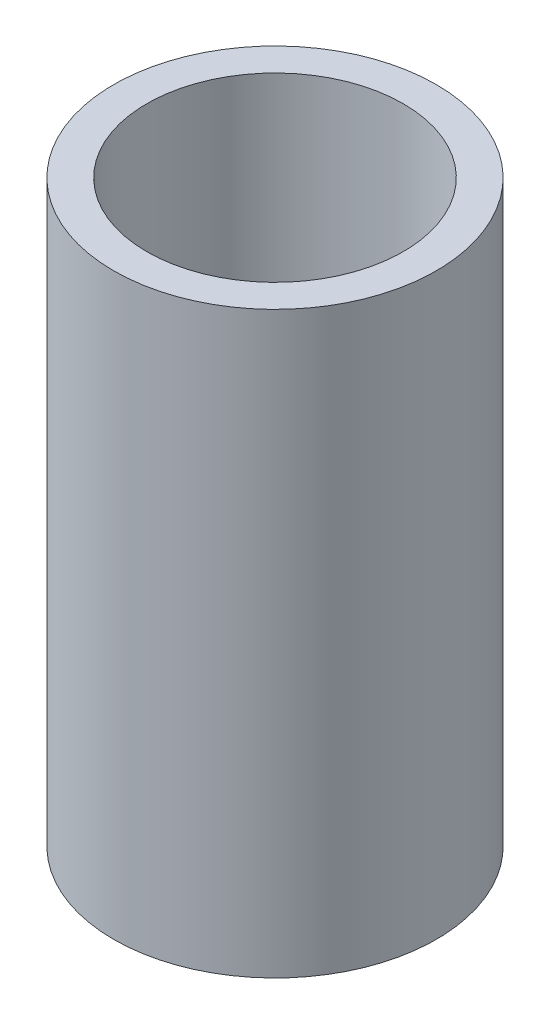
ISO-10303-21;
HEADER;
FILE_DESCRIPTION(('STEP AP214'),'2;1');
FILE_NAME('part.step','',(''),(''),'','','');
FILE_SCHEMA(('AUTOMOTIVE_DESIGN { 1 0 10303 214 1 1 1 1 }'));
ENDSEC;
DATA;
#1=APPLICATION_CONTEXT('core data for automotive mechanical design processes');
#2=APPLICATION_PROTOCOL_DEFINITION('international standard','automotive_design',2000,#1);
#3=PRODUCT_CONTEXT('',#1,'mechanical');
#4=PRODUCT('Part','Part','',(#3));
#5=PRODUCT_RELATED_PRODUCT_CATEGORY('part','',(#4));
#6=PRODUCT_DEFINITION_FORMATION('','',#4);
#7=PRODUCT_DEFINITION_CONTEXT('part definition',#1,'design');
#8=PRODUCT_DEFINITION('design','',#6,#7);
#9=PRODUCT_DEFINITION_SHAPE('','',#8);
#10=(LENGTH_UNIT() NAMED_UNIT(*) SI_UNIT(.MILLI.,.METRE.));
#11=(NAMED_UNIT(*) PLANE_ANGLE_UNIT() SI_UNIT($,.RADIAN.));
#12=(NAMED_UNIT(*) SI_UNIT($,.STERADIAN.) SOLID_ANGLE_UNIT());
#13=UNCERTAINTY_MEASURE_WITH_UNIT(LENGTH_MEASURE(1.E-05),#10,'distance_accuracy_value','');
#14=(GEOMETRIC_REPRESENTATION_CONTEXT(3) GLOBAL_UNCERTAINTY_ASSIGNED_CONTEXT((#13)) GLOBAL_UNIT_ASSIGNED_CONTEXT((#10,
#11,#12)) REPRESENTATION_CONTEXT('',''));
#15=CARTESIAN_POINT('',(0.,0.,0.));
#16=DIRECTION('',(0.,0.,1.));
#17=DIRECTION('',(1.,0.,0.));
#18=AXIS2_PLACEMENT_3D('',#15,#16,#17);
#19=CARTESIAN_POINT('',(0.,35.,0.));
#20=DIRECTION('',(0.,1.,0.));
#21=DIRECTION('',(0.,0.,1.));
#22=AXIS2_PLACEMENT_3D('',#19,#20,#21);
#23=PLANE('',#22);
#24=CARTESIAN_POINT('',(0.,35.,0.));
#25=DIRECTION('',(0.,1.,0.));
#26=DIRECTION('',(0.,0.,1.));
#27=AXIS2_PLACEMENT_3D('',#24,#25,#26);
#28=CIRCLE('',#27,9.75);
#29=CARTESIAN_POINT('',(0.,35.,9.75));
#30=VERTEX_POINT('',#29);
#31=EDGE_CURVE('E10',#30,#30,#28,.T.);
#32=ORIENTED_EDGE('',*,*,#31,.T.);
#33=EDGE_LOOP('',(#32));
#34=FACE_BOUND('',#33,.T.);
#35=CARTESIAN_POINT('',(0.,35.,0.));
#36=DIRECTION('',(0.,1.,0.));
#37=DIRECTION('',(0.,0.,1.));
#38=AXIS2_PLACEMENT_3D('',#35,#36,#37);
#39=CIRCLE('',#38,7.75);
#40=CARTESIAN_POINT('',(0.,35.,7.75));
#41=VERTEX_POINT('',#40);
#42=EDGE_CURVE('E43',#41,#41,#39,.T.);
#43=ORIENTED_EDGE('',*,*,#42,.F.);
#44=EDGE_LOOP('',(#43));
#45=FACE_BOUND('',#44,.T.);
#46=ADVANCED_FACE('F32',(#34,#45),#23,.T.);
#47=CARTESIAN_POINT('',(0.,0.,0.));
#48=DIRECTION('',(0.,1.,0.));
#49=DIRECTION('',(0.,0.,1.));
#50=AXIS2_PLACEMENT_3D('',#47,#48,#49);
#51=PLANE('',#50);
#52=CARTESIAN_POINT('',(0.,0.,0.));
#53=DIRECTION('',(0.,1.,0.));
#54=DIRECTION('',(0.,0.,1.));
#55=AXIS2_PLACEMENT_3D('',#52,#53,#54);
#56=CIRCLE('',#55,9.75);
#57=CARTESIAN_POINT('',(0.,0.,9.75));
#58=VERTEX_POINT('',#57);
#59=EDGE_CURVE('E36',#58,#58,#56,.T.);
#60=ORIENTED_EDGE('',*,*,#59,.F.);
#61=EDGE_LOOP('',(#60));
#62=FACE_BOUND('',#61,.T.);
#63=CARTESIAN_POINT('',(0.,0.,0.));
#64=DIRECTION('',(0.,1.,0.));
#65=DIRECTION('',(0.,0.,1.));
#66=AXIS2_PLACEMENT_3D('',#63,#64,#65);
#67=CIRCLE('',#66,7.75);
#68=CARTESIAN_POINT('',(0.,0.,7.75));
#69=VERTEX_POINT('',#68);
#70=EDGE_CURVE('E45',#69,#69,#67,.T.);
#71=ORIENTED_EDGE('',*,*,#70,.T.);
#72=EDGE_LOOP('',(#71));
#73=FACE_BOUND('',#72,.T.);
#74=ADVANCED_FACE('F55',(#62,#73),#51,.F.);
#75=CARTESIAN_POINT('',(0.,35.,0.));
#76=DIRECTION('',(0.,-1.,0.));
#77=DIRECTION('',(0.,0.,-1.));
#78=AXIS2_PLACEMENT_3D('',#75,#76,#77);
#79=CYLINDRICAL_SURFACE('',#78,9.75);
#80=ORIENTED_EDGE('',*,*,#31,.F.);
#81=EDGE_LOOP('',(#80));
#82=FACE_BOUND('',#81,.T.);
#83=ORIENTED_EDGE('',*,*,#59,.T.);
#84=EDGE_LOOP('',(#83));
#85=FACE_BOUND('',#84,.T.);
#86=ADVANCED_FACE('F34',(#82,#85),#79,.T.);
#87=CARTESIAN_POINT('',(0.,35.,0.));
#88=DIRECTION('',(0.,-1.,0.));
#89=DIRECTION('',(0.,0.,-1.));
#90=AXIS2_PLACEMENT_3D('',#87,#88,#89);
#91=CYLINDRICAL_SURFACE('',#90,7.75);
#92=ORIENTED_EDGE('',*,*,#42,.T.);
#93=EDGE_LOOP('',(#92));
#94=FACE_BOUND('',#93,.T.);
#95=ORIENTED_EDGE('',*,*,#70,.F.);
#96=EDGE_LOOP('',(#95));
#97=FACE_BOUND('',#96,.T.);
#98=ADVANCED_FACE('F51',(#94,#97),#91,.F.);
#99=CLOSED_SHELL('',(#46,#74,#86,#98));
#100=MANIFOLD_SOLID_BREP('B2',#99);
#101=ADVANCED_BREP_SHAPE_REPRESENTATION('',(#18,#100),#14);
#102=SHAPE_DEFINITION_REPRESENTATION(#9,#101);
ENDSEC;
END-ISO-10303-21;
